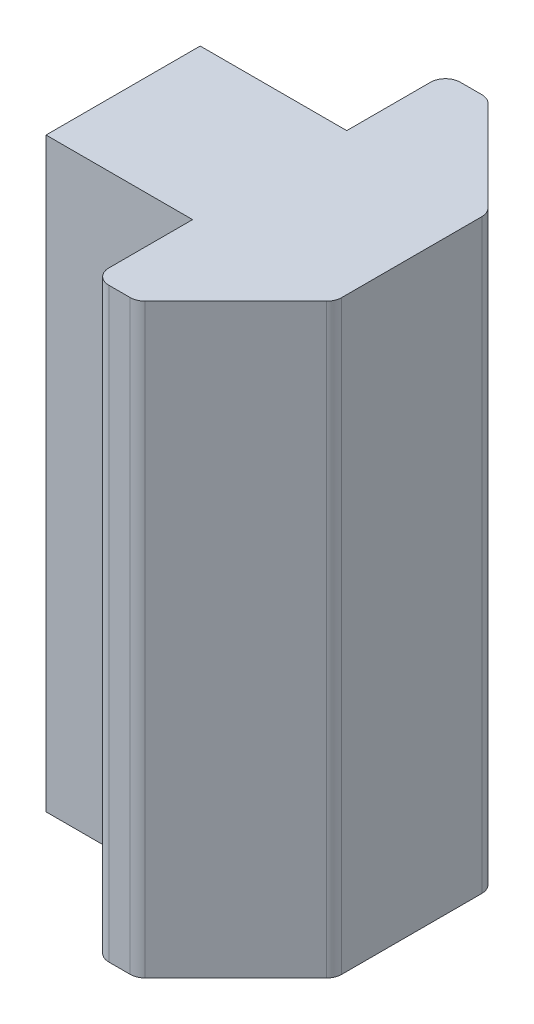
ISO-10303-21;
HEADER;
FILE_DESCRIPTION(('STEP AP214'),'2;1');
FILE_NAME('part.step','',(''),(''),'','','');
FILE_SCHEMA(('AUTOMOTIVE_DESIGN { 1 0 10303 214 1 1 1 1 }'));
ENDSEC;
DATA;
#1=APPLICATION_CONTEXT('core data for automotive mechanical design processes');
#2=APPLICATION_PROTOCOL_DEFINITION('international standard','automotive_design',2000,#1);
#3=PRODUCT_CONTEXT('',#1,'mechanical');
#4=PRODUCT('Part','Part','',(#3));
#5=PRODUCT_RELATED_PRODUCT_CATEGORY('part','',(#4));
#6=PRODUCT_DEFINITION_FORMATION('','',#4);
#7=PRODUCT_DEFINITION_CONTEXT('part definition',#1,'design');
#8=PRODUCT_DEFINITION('design','',#6,#7);
#9=PRODUCT_DEFINITION_SHAPE('','',#8);
#10=(LENGTH_UNIT() NAMED_UNIT(*) SI_UNIT(.MILLI.,.METRE.));
#11=(NAMED_UNIT(*) PLANE_ANGLE_UNIT() SI_UNIT($,.RADIAN.));
#12=(NAMED_UNIT(*) SI_UNIT($,.STERADIAN.) SOLID_ANGLE_UNIT());
#13=UNCERTAINTY_MEASURE_WITH_UNIT(LENGTH_MEASURE(1.E-05),#10,'distance_accuracy_value','');
#14=(GEOMETRIC_REPRESENTATION_CONTEXT(3) GLOBAL_UNCERTAINTY_ASSIGNED_CONTEXT((#13)) GLOBAL_UNIT_ASSIGNED_CONTEXT((#10,
#11,#12)) REPRESENTATION_CONTEXT('',''));
#15=CARTESIAN_POINT('',(0.,0.,0.));
#16=DIRECTION('',(0.,0.,1.));
#17=DIRECTION('',(1.,0.,0.));
#18=AXIS2_PLACEMENT_3D('',#15,#16,#17);
#19=CARTESIAN_POINT('',(-9.84712770159706,20.,2.63));
#20=DIRECTION('',(1.,0.,0.));
#21=DIRECTION('',(0.,0.,-1.));
#22=AXIS2_PLACEMENT_3D('',#19,#20,#21);
#23=PLANE('',#22);
#24=CARTESIAN_POINT('',(-9.84712770159706,10.,0.));
#25=DIRECTION('',(-1.,0.,0.));
#26=DIRECTION('',(0.,0.,1.));
#27=AXIS2_PLACEMENT_3D('',#24,#25,#26);
#28=CIRCLE('',#27,2.1);
#29=CARTESIAN_POINT('',(-9.84712770159706,10.,2.1));
#30=VERTEX_POINT('',#29);
#31=EDGE_CURVE('E364',#30,#30,#28,.T.);
#32=ORIENTED_EDGE('',*,*,#31,.F.);
#33=EDGE_LOOP('',(#32));
#34=FACE_BOUND('',#33,.T.);
#35=DIRECTION('',(0.,0.,1.));
#36=VECTOR('',#35,1.);
#37=CARTESIAN_POINT('',(-9.84712770159706,0.,2.63));
#38=LINE('',#37,#36);
#39=CARTESIAN_POINT('',(-9.84712770159706,0.,-2.63));
#40=VERTEX_POINT('',#39);
#41=CARTESIAN_POINT('',(-9.84712770159706,0.,2.63));
#42=VERTEX_POINT('',#41);
#43=EDGE_CURVE('E188',#40,#42,#38,.T.);
#44=ORIENTED_EDGE('',*,*,#43,.T.);
#45=DIRECTION('',(0.,-1.,0.));
#46=VECTOR('',#45,1.);
#47=CARTESIAN_POINT('',(-9.84712770159706,20.,2.63));
#48=LINE('',#47,#46);
#49=CARTESIAN_POINT('',(-9.84712770159706,20.,2.63));
#50=VERTEX_POINT('',#49);
#51=EDGE_CURVE('E11',#50,#42,#48,.T.);
#52=ORIENTED_EDGE('',*,*,#51,.F.);
#53=DIRECTION('',(0.,0.,1.));
#54=VECTOR('',#53,1.);
#55=CARTESIAN_POINT('',(-9.84712770159706,20.,2.63));
#56=LINE('',#55,#54);
#57=CARTESIAN_POINT('',(-9.84712770159706,20.,-2.63));
#58=VERTEX_POINT('',#57);
#59=EDGE_CURVE('E235',#58,#50,#56,.T.);
#60=ORIENTED_EDGE('',*,*,#59,.F.);
#61=DIRECTION('',(0.,-1.,0.));
#62=VECTOR('',#61,1.);
#63=CARTESIAN_POINT('',(-9.84712770159706,20.,-2.63));
#64=LINE('',#63,#62);
#65=EDGE_CURVE('E184',#58,#40,#64,.T.);
#66=ORIENTED_EDGE('',*,*,#65,.T.);
#67=EDGE_LOOP('',(#44,#52,#60,#66));
#68=FACE_BOUND('',#67,.T.);
#69=ADVANCED_FACE('F39',(#34,#68),#23,.F.);
#70=CARTESIAN_POINT('',(-9.84712770159706,20.,2.63));
#71=DIRECTION('',(0.,0.,-1.));
#72=DIRECTION('',(-1.,0.,0.));
#73=AXIS2_PLACEMENT_3D('',#70,#71,#72);
#74=PLANE('',#73);
#75=DIRECTION('',(1.,0.,0.));
#76=VECTOR('',#75,1.);
#77=CARTESIAN_POINT('',(-9.84712770159706,0.,2.63));
#78=LINE('',#77,#76);
#79=CARTESIAN_POINT('',(-4.84712770159706,0.,2.63));
#80=VERTEX_POINT('',#79);
#81=EDGE_CURVE('E192',#42,#80,#78,.T.);
#82=ORIENTED_EDGE('',*,*,#81,.T.);
#83=DIRECTION('',(0.,-1.,0.));
#84=VECTOR('',#83,1.);
#85=CARTESIAN_POINT('',(-4.84712770159706,20.,2.63));
#86=LINE('',#85,#84);
#87=CARTESIAN_POINT('',(-4.84712770159706,20.,2.63));
#88=VERTEX_POINT('',#87);
#89=EDGE_CURVE('E48',#88,#80,#86,.T.);
#90=ORIENTED_EDGE('',*,*,#89,.F.);
#91=DIRECTION('',(1.,0.,0.));
#92=VECTOR('',#91,1.);
#93=CARTESIAN_POINT('',(-9.84712770159706,20.,2.63));
#94=LINE('',#93,#92);
#95=EDGE_CURVE('E123',#50,#88,#94,.T.);
#96=ORIENTED_EDGE('',*,*,#95,.F.);
#97=ORIENTED_EDGE('',*,*,#51,.T.);
#98=EDGE_LOOP('',(#82,#90,#96,#97));
#99=FACE_BOUND('',#98,.T.);
#100=ADVANCED_FACE('F357',(#99),#74,.F.);
#101=CARTESIAN_POINT('',(-4.84712770159706,20.,2.63));
#102=DIRECTION('',(1.,0.,0.));
#103=DIRECTION('',(0.,0.,-1.));
#104=AXIS2_PLACEMENT_3D('',#101,#102,#103);
#105=PLANE('',#104);
#106=DIRECTION('',(0.,0.,1.));
#107=VECTOR('',#106,1.);
#108=CARTESIAN_POINT('',(-4.84712770159706,0.,2.63));
#109=LINE('',#108,#107);
#110=CARTESIAN_POINT('',(-4.84712770159706,0.,5.48712770159707));
#111=VERTEX_POINT('',#110);
#112=EDGE_CURVE('E196',#80,#111,#109,.T.);
#113=ORIENTED_EDGE('',*,*,#112,.T.);
#114=DIRECTION('',(0.,-1.,0.));
#115=VECTOR('',#114,1.);
#116=CARTESIAN_POINT('',(-4.84712770159706,20.,5.48712770159707));
#117=LINE('',#116,#115);
#118=CARTESIAN_POINT('',(-4.84712770159706,20.,5.48712770159707));
#119=VERTEX_POINT('',#118);
#120=EDGE_CURVE('E278',#119,#111,#117,.T.);
#121=ORIENTED_EDGE('',*,*,#120,.F.);
#122=DIRECTION('',(0.,0.,1.));
#123=VECTOR('',#122,1.);
#124=CARTESIAN_POINT('',(-4.84712770159706,20.,2.63));
#125=LINE('',#124,#123);
#126=EDGE_CURVE('E288',#88,#119,#125,.T.);
#127=ORIENTED_EDGE('',*,*,#126,.F.);
#128=ORIENTED_EDGE('',*,*,#89,.T.);
#129=EDGE_LOOP('',(#113,#121,#127,#128));
#130=FACE_BOUND('',#129,.T.);
#131=ADVANCED_FACE('F286',(#130),#105,.F.);
#132=CARTESIAN_POINT('',(-4.33712770159706,20.,5.48712770159707));
#133=DIRECTION('',(0.,-1.,0.));
#134=DIRECTION('',(0.,0.,-1.));
#135=AXIS2_PLACEMENT_3D('',#132,#133,#134);
#136=CYLINDRICAL_SURFACE('',#135,0.51);
#137=CARTESIAN_POINT('',(-4.33712770159706,0.,5.48712770159707));
#138=DIRECTION('',(0.,1.,0.));
#139=DIRECTION('',(0.,0.,1.));
#140=AXIS2_PLACEMENT_3D('',#137,#138,#139);
#141=CIRCLE('',#140,0.51);
#142=CARTESIAN_POINT('',(-4.33712770159706,0.,5.99712770159707));
#143=VERTEX_POINT('',#142);
#144=EDGE_CURVE('E199',#111,#143,#141,.T.);
#145=ORIENTED_EDGE('',*,*,#144,.T.);
#146=DIRECTION('',(0.,-1.,0.));
#147=VECTOR('',#146,1.);
#148=CARTESIAN_POINT('',(-4.33712770159706,20.,5.99712770159707));
#149=LINE('',#148,#147);
#150=CARTESIAN_POINT('',(-4.33712770159706,20.,5.99712770159707));
#151=VERTEX_POINT('',#150);
#152=EDGE_CURVE('E274',#151,#143,#149,.T.);
#153=ORIENTED_EDGE('',*,*,#152,.F.);
#154=CARTESIAN_POINT('',(-4.33712770159706,20.,5.48712770159707));
#155=DIRECTION('',(0.,1.,0.));
#156=DIRECTION('',(0.,0.,1.));
#157=AXIS2_PLACEMENT_3D('',#154,#155,#156);
#158=CIRCLE('',#157,0.51);
#159=EDGE_CURVE('E307',#119,#151,#158,.T.);
#160=ORIENTED_EDGE('',*,*,#159,.F.);
#161=ORIENTED_EDGE('',*,*,#120,.T.);
#162=EDGE_LOOP('',(#145,#153,#160,#161));
#163=FACE_BOUND('',#162,.T.);
#164=ADVANCED_FACE('F297',(#163),#136,.T.);
#165=CARTESIAN_POINT('',(-4.33712770159706,20.,5.99712770159707));
#166=DIRECTION('',(0.,0.,-1.));
#167=DIRECTION('',(-1.,0.,0.));
#168=AXIS2_PLACEMENT_3D('',#165,#166,#167);
#169=PLANE('',#168);
#170=DIRECTION('',(1.,0.,0.));
#171=VECTOR('',#170,1.);
#172=CARTESIAN_POINT('',(-4.33712770159706,0.,5.99712770159707));
#173=LINE('',#172,#171);
#174=CARTESIAN_POINT('',(-3.60712770159708,0.,5.99712770159707));
#175=VERTEX_POINT('',#174);
#176=EDGE_CURVE('E202',#143,#175,#173,.T.);
#177=ORIENTED_EDGE('',*,*,#176,.T.);
#178=DIRECTION('',(0.,-1.,0.));
#179=VECTOR('',#178,1.);
#180=CARTESIAN_POINT('',(-3.60712770159708,20.,5.99712770159707));
#181=LINE('',#180,#179);
#182=CARTESIAN_POINT('',(-3.60712770159708,20.,5.99712770159707));
#183=VERTEX_POINT('',#182);
#184=EDGE_CURVE('E270',#183,#175,#181,.T.);
#185=ORIENTED_EDGE('',*,*,#184,.F.);
#186=DIRECTION('',(1.,0.,0.));
#187=VECTOR('',#186,1.);
#188=CARTESIAN_POINT('',(-4.33712770159706,20.,5.99712770159707));
#189=LINE('',#188,#187);
#190=EDGE_CURVE('E303',#151,#183,#189,.T.);
#191=ORIENTED_EDGE('',*,*,#190,.F.);
#192=ORIENTED_EDGE('',*,*,#152,.T.);
#193=EDGE_LOOP('',(#177,#185,#191,#192));
#194=FACE_BOUND('',#193,.T.);
#195=ADVANCED_FACE('F301',(#194),#169,.F.);
#196=CARTESIAN_POINT('',(-3.60712770159708,20.,5.48712770159707));
#197=DIRECTION('',(0.,-1.,0.));
#198=DIRECTION('',(0.,0.,-1.));
#199=AXIS2_PLACEMENT_3D('',#196,#197,#198);
#200=CYLINDRICAL_SURFACE('',#199,0.510000000000001);
#201=CARTESIAN_POINT('',(-3.60712770159708,0.,5.48712770159707));
#202=DIRECTION('',(0.,1.,0.));
#203=DIRECTION('',(0.,0.,1.));
#204=AXIS2_PLACEMENT_3D('',#201,#202,#203);
#205=CIRCLE('',#204,0.510000000000001);
#206=CARTESIAN_POINT('',(-3.24650324319195,0.,5.84775216000221));
#207=VERTEX_POINT('',#206);
#208=EDGE_CURVE('E205',#175,#207,#205,.T.);
#209=ORIENTED_EDGE('',*,*,#208,.T.);
#210=DIRECTION('',(0.,-1.,0.));
#211=VECTOR('',#210,1.);
#212=CARTESIAN_POINT('',(-3.24650324319195,20.,5.84775216000221));
#213=LINE('',#212,#211);
#214=CARTESIAN_POINT('',(-3.24650324319195,20.,5.84775216000221));
#215=VERTEX_POINT('',#214);
#216=EDGE_CURVE('E266',#215,#207,#213,.T.);
#217=ORIENTED_EDGE('',*,*,#216,.F.);
#218=CARTESIAN_POINT('',(-3.60712770159708,20.,5.48712770159707));
#219=DIRECTION('',(0.,1.,0.));
#220=DIRECTION('',(0.,0.,1.));
#221=AXIS2_PLACEMENT_3D('',#218,#219,#220);
#222=CIRCLE('',#221,0.510000000000001);
#223=EDGE_CURVE('E306',#183,#215,#222,.T.);
#224=ORIENTED_EDGE('',*,*,#223,.F.);
#225=ORIENTED_EDGE('',*,*,#184,.T.);
#226=EDGE_LOOP('',(#209,#217,#224,#225));
#227=FACE_BOUND('',#226,.T.);
#228=ADVANCED_FACE('F478',(#227),#200,.T.);
#229=CARTESIAN_POINT('',(-3.24650324319195,20.,5.84775216000221));
#230=DIRECTION('',(-0.707106781186546,0.,-0.707106781186549));
#231=DIRECTION('',(-0.707106781186549,0.,0.707106781186546));
#232=AXIS2_PLACEMENT_3D('',#229,#230,#231);
#233=PLANE('',#232);
#234=DIRECTION('',(0.707106781186549,0.,-0.707106781186546));
#235=VECTOR('',#234,1.);
#236=CARTESIAN_POINT('',(-3.24650324319195,0.,5.84775216000221));
#237=LINE('',#236,#235);
#238=CARTESIAN_POINT('',(-0.149375541594863,0.,2.75062445840514));
#239=VERTEX_POINT('',#238);
#240=EDGE_CURVE('E208',#207,#239,#237,.T.);
#241=ORIENTED_EDGE('',*,*,#240,.T.);
#242=DIRECTION('',(0.,-1.,0.));
#243=VECTOR('',#242,1.);
#244=CARTESIAN_POINT('',(-0.149375541594863,20.,2.75062445840514));
#245=LINE('',#244,#243);
#246=CARTESIAN_POINT('',(-0.149375541594863,20.,2.75062445840514));
#247=VERTEX_POINT('',#246);
#248=EDGE_CURVE('E262',#247,#239,#245,.T.);
#249=ORIENTED_EDGE('',*,*,#248,.F.);
#250=DIRECTION('',(0.707106781186549,0.,-0.707106781186546));
#251=VECTOR('',#250,1.);
#252=CARTESIAN_POINT('',(-3.24650324319195,20.,5.84775216000221));
#253=LINE('',#252,#251);
#254=EDGE_CURVE('E311',#215,#247,#253,.T.);
#255=ORIENTED_EDGE('',*,*,#254,.F.);
#256=ORIENTED_EDGE('',*,*,#216,.T.);
#257=EDGE_LOOP('',(#241,#249,#255,#256));
#258=FACE_BOUND('',#257,.T.);
#259=ADVANCED_FACE('F468',(#258),#233,.F.);
#260=CARTESIAN_POINT('',(-0.51,20.,2.39));
#261=DIRECTION('',(0.,-1.,0.));
#262=DIRECTION('',(0.,0.,-1.));
#263=AXIS2_PLACEMENT_3D('',#260,#261,#262);
#264=CYLINDRICAL_SURFACE('',#263,0.51);
#265=CARTESIAN_POINT('',(-0.51,0.,2.39));
#266=DIRECTION('',(0.,1.,0.));
#267=DIRECTION('',(0.,0.,1.));
#268=AXIS2_PLACEMENT_3D('',#265,#266,#267);
#269=CIRCLE('',#268,0.51);
#270=CARTESIAN_POINT('',(0.,0.,2.39));
#271=VERTEX_POINT('',#270);
#272=EDGE_CURVE('E211',#239,#271,#269,.T.);
#273=ORIENTED_EDGE('',*,*,#272,.T.);
#274=DIRECTION('',(0.,-1.,0.));
#275=VECTOR('',#274,1.);
#276=CARTESIAN_POINT('',(0.,20.,2.39));
#277=LINE('',#276,#275);
#278=CARTESIAN_POINT('',(0.,20.,2.39));
#279=VERTEX_POINT('',#278);
#280=EDGE_CURVE('E258',#279,#271,#277,.T.);
#281=ORIENTED_EDGE('',*,*,#280,.F.);
#282=CARTESIAN_POINT('',(-0.51,20.,2.39));
#283=DIRECTION('',(0.,1.,0.));
#284=DIRECTION('',(0.,0.,1.));
#285=AXIS2_PLACEMENT_3D('',#282,#283,#284);
#286=CIRCLE('',#285,0.51);
#287=EDGE_CURVE('E318',#247,#279,#286,.T.);
#288=ORIENTED_EDGE('',*,*,#287,.F.);
#289=ORIENTED_EDGE('',*,*,#248,.T.);
#290=EDGE_LOOP('',(#273,#281,#288,#289));
#291=FACE_BOUND('',#290,.T.);
#292=ADVANCED_FACE('F458',(#291),#264,.T.);
#293=CARTESIAN_POINT('',(0.,20.,-2.39));
#294=DIRECTION('',(-1.,0.,0.));
#295=DIRECTION('',(0.,0.,1.));
#296=AXIS2_PLACEMENT_3D('',#293,#294,#295);
#297=PLANE('',#296);
#298=DIRECTION('',(0.,0.,-1.));
#299=VECTOR('',#298,1.);
#300=CARTESIAN_POINT('',(0.,0.,-2.39));
#301=LINE('',#300,#299);
#302=CARTESIAN_POINT('',(0.,0.,-2.39));
#303=VERTEX_POINT('',#302);
#304=EDGE_CURVE('E214',#271,#303,#301,.T.);
#305=ORIENTED_EDGE('',*,*,#304,.T.);
#306=DIRECTION('',(0.,-1.,0.));
#307=VECTOR('',#306,1.);
#308=CARTESIAN_POINT('',(0.,20.,-2.39));
#309=LINE('',#308,#307);
#310=CARTESIAN_POINT('',(0.,20.,-2.39));
#311=VERTEX_POINT('',#310);
#312=EDGE_CURVE('E254',#311,#303,#309,.T.);
#313=ORIENTED_EDGE('',*,*,#312,.F.);
#314=DIRECTION('',(0.,0.,-1.));
#315=VECTOR('',#314,1.);
#316=CARTESIAN_POINT('',(0.,20.,-2.39));
#317=LINE('',#316,#315);
#318=EDGE_CURVE('E321',#279,#311,#317,.T.);
#319=ORIENTED_EDGE('',*,*,#318,.F.);
#320=ORIENTED_EDGE('',*,*,#280,.T.);
#321=EDGE_LOOP('',(#305,#313,#319,#320));
#322=FACE_BOUND('',#321,.T.);
#323=ADVANCED_FACE('F448',(#322),#297,.F.);
#324=CARTESIAN_POINT('',(-0.51,20.,-2.39));
#325=DIRECTION('',(0.,-1.,0.));
#326=DIRECTION('',(0.,0.,-1.));
#327=AXIS2_PLACEMENT_3D('',#324,#325,#326);
#328=CYLINDRICAL_SURFACE('',#327,0.51);
#329=CARTESIAN_POINT('',(-0.51,0.,-2.39));
#330=DIRECTION('',(0.,1.,0.));
#331=DIRECTION('',(0.,0.,-1.));
#332=AXIS2_PLACEMENT_3D('',#329,#330,#331);
#333=CIRCLE('',#332,0.51);
#334=CARTESIAN_POINT('',(-0.149375541594861,0.,-2.75062445840514));
#335=VERTEX_POINT('',#334);
#336=EDGE_CURVE('E217',#303,#335,#333,.T.);
#337=ORIENTED_EDGE('',*,*,#336,.T.);
#338=DIRECTION('',(0.,-1.,0.));
#339=VECTOR('',#338,1.);
#340=CARTESIAN_POINT('',(-0.149375541594861,20.,-2.75062445840514));
#341=LINE('',#340,#339);
#342=CARTESIAN_POINT('',(-0.149375541594861,20.,-2.75062445840514));
#343=VERTEX_POINT('',#342);
#344=EDGE_CURVE('E250',#343,#335,#341,.T.);
#345=ORIENTED_EDGE('',*,*,#344,.F.);
#346=CARTESIAN_POINT('',(-0.51,20.,-2.39));
#347=DIRECTION('',(0.,1.,0.));
#348=DIRECTION('',(0.,0.,-1.));
#349=AXIS2_PLACEMENT_3D('',#346,#347,#348);
#350=CIRCLE('',#349,0.51);
#351=EDGE_CURVE('E324',#311,#343,#350,.T.);
#352=ORIENTED_EDGE('',*,*,#351,.F.);
#353=ORIENTED_EDGE('',*,*,#312,.T.);
#354=EDGE_LOOP('',(#337,#345,#352,#353));
#355=FACE_BOUND('',#354,.T.);
#356=ADVANCED_FACE('F438',(#355),#328,.T.);
#357=CARTESIAN_POINT('',(-3.24650324319195,20.,-5.84775216000221));
#358=DIRECTION('',(-0.707106781186546,0.,0.707106781186549));
#359=DIRECTION('',(0.707106781186549,0.,0.707106781186546));
#360=AXIS2_PLACEMENT_3D('',#357,#358,#359);
#361=PLANE('',#360);
#362=DIRECTION('',(-0.707106781186549,0.,-0.707106781186546));
#363=VECTOR('',#362,1.);
#364=CARTESIAN_POINT('',(-3.24650324319195,0.,-5.84775216000221));
#365=LINE('',#364,#363);
#366=CARTESIAN_POINT('',(-3.24650324319195,0.,-5.84775216000221));
#367=VERTEX_POINT('',#366);
#368=EDGE_CURVE('E220',#335,#367,#365,.T.);
#369=ORIENTED_EDGE('',*,*,#368,.T.);
#370=DIRECTION('',(0.,-1.,0.));
#371=VECTOR('',#370,1.);
#372=CARTESIAN_POINT('',(-3.24650324319195,20.,-5.84775216000221));
#373=LINE('',#372,#371);
#374=CARTESIAN_POINT('',(-3.24650324319195,20.,-5.84775216000221));
#375=VERTEX_POINT('',#374);
#376=EDGE_CURVE('E246',#375,#367,#373,.T.);
#377=ORIENTED_EDGE('',*,*,#376,.F.);
#378=DIRECTION('',(-0.707106781186549,0.,-0.707106781186546));
#379=VECTOR('',#378,1.);
#380=CARTESIAN_POINT('',(-3.24650324319195,20.,-5.84775216000221));
#381=LINE('',#380,#379);
#382=EDGE_CURVE('E327',#343,#375,#381,.T.);
#383=ORIENTED_EDGE('',*,*,#382,.F.);
#384=ORIENTED_EDGE('',*,*,#344,.T.);
#385=EDGE_LOOP('',(#369,#377,#383,#384));
#386=FACE_BOUND('',#385,.T.);
#387=ADVANCED_FACE('F429',(#386),#361,.F.);
#388=CARTESIAN_POINT('',(-3.60712770159708,20.,-5.48712770159707));
#389=DIRECTION('',(0.,-1.,0.));
#390=DIRECTION('',(0.,0.,-1.));
#391=AXIS2_PLACEMENT_3D('',#388,#389,#390);
#392=CYLINDRICAL_SURFACE('',#391,0.510000000000001);
#393=CARTESIAN_POINT('',(-3.60712770159708,0.,-5.48712770159707));
#394=DIRECTION('',(0.,1.,0.));
#395=DIRECTION('',(0.,0.,-1.));
#396=AXIS2_PLACEMENT_3D('',#393,#394,#395);
#397=CIRCLE('',#396,0.510000000000001);
#398=CARTESIAN_POINT('',(-3.60712770159708,0.,-5.99712770159707));
#399=VERTEX_POINT('',#398);
#400=EDGE_CURVE('E223',#367,#399,#397,.T.);
#401=ORIENTED_EDGE('',*,*,#400,.T.);
#402=DIRECTION('',(0.,-1.,0.));
#403=VECTOR('',#402,1.);
#404=CARTESIAN_POINT('',(-3.60712770159708,20.,-5.99712770159707));
#405=LINE('',#404,#403);
#406=CARTESIAN_POINT('',(-3.60712770159708,20.,-5.99712770159707));
#407=VERTEX_POINT('',#406);
#408=EDGE_CURVE('E242',#407,#399,#405,.T.);
#409=ORIENTED_EDGE('',*,*,#408,.F.);
#410=CARTESIAN_POINT('',(-3.60712770159708,20.,-5.48712770159707));
#411=DIRECTION('',(0.,1.,0.));
#412=DIRECTION('',(0.,0.,-1.));
#413=AXIS2_PLACEMENT_3D('',#410,#411,#412);
#414=CIRCLE('',#413,0.510000000000001);
#415=EDGE_CURVE('E330',#375,#407,#414,.T.);
#416=ORIENTED_EDGE('',*,*,#415,.F.);
#417=ORIENTED_EDGE('',*,*,#376,.T.);
#418=EDGE_LOOP('',(#401,#409,#416,#417));
#419=FACE_BOUND('',#418,.T.);
#420=ADVANCED_FACE('F338',(#419),#392,.T.);
#421=CARTESIAN_POINT('',(-4.33712770159706,20.,-5.99712770159707));
#422=DIRECTION('',(0.,0.,1.));
#423=DIRECTION('',(1.,0.,0.));
#424=AXIS2_PLACEMENT_3D('',#421,#422,#423);
#425=PLANE('',#424);
#426=DIRECTION('',(-1.,0.,0.));
#427=VECTOR('',#426,1.);
#428=CARTESIAN_POINT('',(-4.33712770159706,0.,-5.99712770159707));
#429=LINE('',#428,#427);
#430=CARTESIAN_POINT('',(-4.33712770159706,0.,-5.99712770159707));
#431=VERTEX_POINT('',#430);
#432=EDGE_CURVE('E226',#399,#431,#429,.T.);
#433=ORIENTED_EDGE('',*,*,#432,.T.);
#434=DIRECTION('',(0.,-1.,0.));
#435=VECTOR('',#434,1.);
#436=CARTESIAN_POINT('',(-4.33712770159706,20.,-5.99712770159707));
#437=LINE('',#436,#435);
#438=CARTESIAN_POINT('',(-4.33712770159706,20.,-5.99712770159707));
#439=VERTEX_POINT('',#438);
#440=EDGE_CURVE('E177',#439,#431,#437,.T.);
#441=ORIENTED_EDGE('',*,*,#440,.F.);
#442=DIRECTION('',(-1.,0.,0.));
#443=VECTOR('',#442,1.);
#444=CARTESIAN_POINT('',(-4.33712770159706,20.,-5.99712770159707));
#445=LINE('',#444,#443);
#446=EDGE_CURVE('E166',#407,#439,#445,.T.);
#447=ORIENTED_EDGE('',*,*,#446,.F.);
#448=ORIENTED_EDGE('',*,*,#408,.T.);
#449=EDGE_LOOP('',(#433,#441,#447,#448));
#450=FACE_BOUND('',#449,.T.);
#451=ADVANCED_FACE('F342',(#450),#425,.F.);
#452=CARTESIAN_POINT('',(-4.33712770159706,20.,-5.48712770159707));
#453=DIRECTION('',(0.,-1.,0.));
#454=DIRECTION('',(0.,0.,-1.));
#455=AXIS2_PLACEMENT_3D('',#452,#453,#454);
#456=CYLINDRICAL_SURFACE('',#455,0.51);
#457=CARTESIAN_POINT('',(-4.33712770159706,0.,-5.48712770159707));
#458=DIRECTION('',(0.,1.,0.));
#459=DIRECTION('',(0.,0.,-1.));
#460=AXIS2_PLACEMENT_3D('',#457,#458,#459);
#461=CIRCLE('',#460,0.51);
#462=CARTESIAN_POINT('',(-4.84712770159706,0.,-5.48712770159707));
#463=VERTEX_POINT('',#462);
#464=EDGE_CURVE('E175',#431,#463,#461,.T.);
#465=ORIENTED_EDGE('',*,*,#464,.T.);
#466=DIRECTION('',(0.,-1.,0.));
#467=VECTOR('',#466,1.);
#468=CARTESIAN_POINT('',(-4.84712770159706,20.,-5.48712770159707));
#469=LINE('',#468,#467);
#470=CARTESIAN_POINT('',(-4.84712770159706,20.,-5.48712770159707));
#471=VERTEX_POINT('',#470);
#472=EDGE_CURVE('E172',#471,#463,#469,.T.);
#473=ORIENTED_EDGE('',*,*,#472,.F.);
#474=CARTESIAN_POINT('',(-4.33712770159706,20.,-5.48712770159707));
#475=DIRECTION('',(0.,1.,0.));
#476=DIRECTION('',(0.,0.,-1.));
#477=AXIS2_PLACEMENT_3D('',#474,#475,#476);
#478=CIRCLE('',#477,0.51);
#479=EDGE_CURVE('E160',#439,#471,#478,.T.);
#480=ORIENTED_EDGE('',*,*,#479,.F.);
#481=ORIENTED_EDGE('',*,*,#440,.T.);
#482=EDGE_LOOP('',(#465,#473,#480,#481));
#483=FACE_BOUND('',#482,.T.);
#484=ADVANCED_FACE('F173',(#483),#456,.T.);
#485=CARTESIAN_POINT('',(-4.84712770159706,20.,-5.48712770159707));
#486=DIRECTION('',(1.,0.,0.));
#487=DIRECTION('',(0.,0.,-1.));
#488=AXIS2_PLACEMENT_3D('',#485,#486,#487);
#489=PLANE('',#488);
#490=DIRECTION('',(0.,0.,1.));
#491=VECTOR('',#490,1.);
#492=CARTESIAN_POINT('',(-4.84712770159706,0.,-5.48712770159707));
#493=LINE('',#492,#491);
#494=CARTESIAN_POINT('',(-4.84712770159706,0.,-2.63));
#495=VERTEX_POINT('',#494);
#496=EDGE_CURVE('E109',#463,#495,#493,.T.);
#497=ORIENTED_EDGE('',*,*,#496,.T.);
#498=DIRECTION('',(0.,-1.,0.));
#499=VECTOR('',#498,1.);
#500=CARTESIAN_POINT('',(-4.84712770159706,20.,-2.63));
#501=LINE('',#500,#499);
#502=CARTESIAN_POINT('',(-4.84712770159706,20.,-2.63));
#503=VERTEX_POINT('',#502);
#504=EDGE_CURVE('E178',#503,#495,#501,.T.);
#505=ORIENTED_EDGE('',*,*,#504,.F.);
#506=DIRECTION('',(0.,0.,1.));
#507=VECTOR('',#506,1.);
#508=CARTESIAN_POINT('',(-4.84712770159706,20.,-5.48712770159707));
#509=LINE('',#508,#507);
#510=EDGE_CURVE('E164',#471,#503,#509,.T.);
#511=ORIENTED_EDGE('',*,*,#510,.F.);
#512=ORIENTED_EDGE('',*,*,#472,.T.);
#513=EDGE_LOOP('',(#497,#505,#511,#512));
#514=FACE_BOUND('',#513,.T.);
#515=ADVANCED_FACE('F180',(#514),#489,.F.);
#516=CARTESIAN_POINT('',(-9.84712770159706,20.,-2.63));
#517=DIRECTION('',(0.,0.,1.));
#518=DIRECTION('',(1.,0.,0.));
#519=AXIS2_PLACEMENT_3D('',#516,#517,#518);
#520=PLANE('',#519);
#521=DIRECTION('',(-1.,0.,0.));
#522=VECTOR('',#521,1.);
#523=CARTESIAN_POINT('',(-9.84712770159706,0.,-2.63));
#524=LINE('',#523,#522);
#525=EDGE_CURVE('E115',#495,#40,#524,.T.);
#526=ORIENTED_EDGE('',*,*,#525,.T.);
#527=ORIENTED_EDGE('',*,*,#65,.F.);
#528=DIRECTION('',(-1.,0.,0.));
#529=VECTOR('',#528,1.);
#530=CARTESIAN_POINT('',(-9.84712770159706,20.,-2.63));
#531=LINE('',#530,#529);
#532=EDGE_CURVE('E56',#503,#58,#531,.T.);
#533=ORIENTED_EDGE('',*,*,#532,.F.);
#534=ORIENTED_EDGE('',*,*,#504,.T.);
#535=EDGE_LOOP('',(#526,#527,#533,#534));
#536=FACE_BOUND('',#535,.T.);
#537=ADVANCED_FACE('F346',(#536),#520,.F.);
#538=CARTESIAN_POINT('',(-4.33712770159706,20.,-5.48712770159707));
#539=DIRECTION('',(0.,-1.,0.));
#540=DIRECTION('',(0.,0.,-1.));
#541=AXIS2_PLACEMENT_3D('',#538,#539,#540);
#542=PLANE('',#541);
#543=ORIENTED_EDGE('',*,*,#59,.T.);
#544=ORIENTED_EDGE('',*,*,#95,.T.);
#545=ORIENTED_EDGE('',*,*,#126,.T.);
#546=ORIENTED_EDGE('',*,*,#159,.T.);
#547=ORIENTED_EDGE('',*,*,#190,.T.);
#548=ORIENTED_EDGE('',*,*,#223,.T.);
#549=ORIENTED_EDGE('',*,*,#254,.T.);
#550=ORIENTED_EDGE('',*,*,#287,.T.);
#551=ORIENTED_EDGE('',*,*,#318,.T.);
#552=ORIENTED_EDGE('',*,*,#351,.T.);
#553=ORIENTED_EDGE('',*,*,#382,.T.);
#554=ORIENTED_EDGE('',*,*,#415,.T.);
#555=ORIENTED_EDGE('',*,*,#446,.T.);
#556=ORIENTED_EDGE('',*,*,#479,.T.);
#557=ORIENTED_EDGE('',*,*,#510,.T.);
#558=ORIENTED_EDGE('',*,*,#532,.T.);
#559=EDGE_LOOP('',(#543,#544,#545,#546,#547,#548,#549,#550,#551,#552,#553,#554,#555,#556,#557,#558));
#560=FACE_BOUND('',#559,.T.);
#561=ADVANCED_FACE('F162',(#560),#542,.F.);
#562=CARTESIAN_POINT('',(-4.33712770159706,0.,-5.48712770159707));
#563=DIRECTION('',(0.,-1.,0.));
#564=DIRECTION('',(0.,0.,-1.));
#565=AXIS2_PLACEMENT_3D('',#562,#563,#564);
#566=PLANE('',#565);
#567=ORIENTED_EDGE('',*,*,#43,.F.);
#568=ORIENTED_EDGE('',*,*,#525,.F.);
#569=ORIENTED_EDGE('',*,*,#496,.F.);
#570=ORIENTED_EDGE('',*,*,#464,.F.);
#571=ORIENTED_EDGE('',*,*,#432,.F.);
#572=ORIENTED_EDGE('',*,*,#400,.F.);
#573=ORIENTED_EDGE('',*,*,#368,.F.);
#574=ORIENTED_EDGE('',*,*,#336,.F.);
#575=ORIENTED_EDGE('',*,*,#304,.F.);
#576=ORIENTED_EDGE('',*,*,#272,.F.);
#577=ORIENTED_EDGE('',*,*,#240,.F.);
#578=ORIENTED_EDGE('',*,*,#208,.F.);
#579=ORIENTED_EDGE('',*,*,#176,.F.);
#580=ORIENTED_EDGE('',*,*,#144,.F.);
#581=ORIENTED_EDGE('',*,*,#112,.F.);
#582=ORIENTED_EDGE('',*,*,#81,.F.);
#583=EDGE_LOOP('',(#567,#568,#569,#570,#571,#572,#573,#574,#575,#576,#577,#578,#579,#580,#581,#582));
#584=FACE_BOUND('',#583,.T.);
#585=ADVANCED_FACE('F292',(#584),#566,.T.);
#586=CARTESIAN_POINT('',(-3.84712770159706,10.,0.));
#587=DIRECTION('',(-1.,0.,0.));
#588=DIRECTION('',(0.,0.,1.));
#589=AXIS2_PLACEMENT_3D('',#586,#587,#588);
#590=CYLINDRICAL_SURFACE('',#589,2.1);
#591=CARTESIAN_POINT('',(-3.84712770159706,10.,0.));
#592=DIRECTION('',(-1.,0.,0.));
#593=DIRECTION('',(0.,0.,1.));
#594=AXIS2_PLACEMENT_3D('',#591,#592,#593);
#595=CIRCLE('',#594,2.1);
#596=CARTESIAN_POINT('',(-3.84712770159706,10.,2.1));
#597=VERTEX_POINT('',#596);
#598=EDGE_CURVE('E193',#597,#597,#595,.T.);
#599=ORIENTED_EDGE('',*,*,#598,.F.);
#600=EDGE_LOOP('',(#599));
#601=FACE_BOUND('',#600,.T.);
#602=ORIENTED_EDGE('',*,*,#31,.T.);
#603=EDGE_LOOP('',(#602));
#604=FACE_BOUND('',#603,.T.);
#605=ADVANCED_FACE('F380',(#601,#604),#590,.F.);
#606=CARTESIAN_POINT('',(-3.84712770159706,10.,0.));
#607=DIRECTION('',(-1.,0.,0.));
#608=DIRECTION('',(0.,0.,1.));
#609=AXIS2_PLACEMENT_3D('',#606,#607,#608);
#610=PLANE('',#609);
#611=ORIENTED_EDGE('',*,*,#598,.T.);
#612=EDGE_LOOP('',(#611));
#613=FACE_BOUND('',#612,.T.);
#614=ADVANCED_FACE('F378',(#613),#610,.T.);
#615=CLOSED_SHELL('',(#69,#100,#131,#164,#195,#228,#259,#292,#323,#356,#387,#420,#451,#484,#515,
#537,#561,#585,#605,#614));
#616=MANIFOLD_SOLID_BREP('B2',#615);
#617=ADVANCED_BREP_SHAPE_REPRESENTATION('',(#18,#616),#14);
#618=SHAPE_DEFINITION_REPRESENTATION(#9,#617);
ENDSEC;
END-ISO-10303-21;
